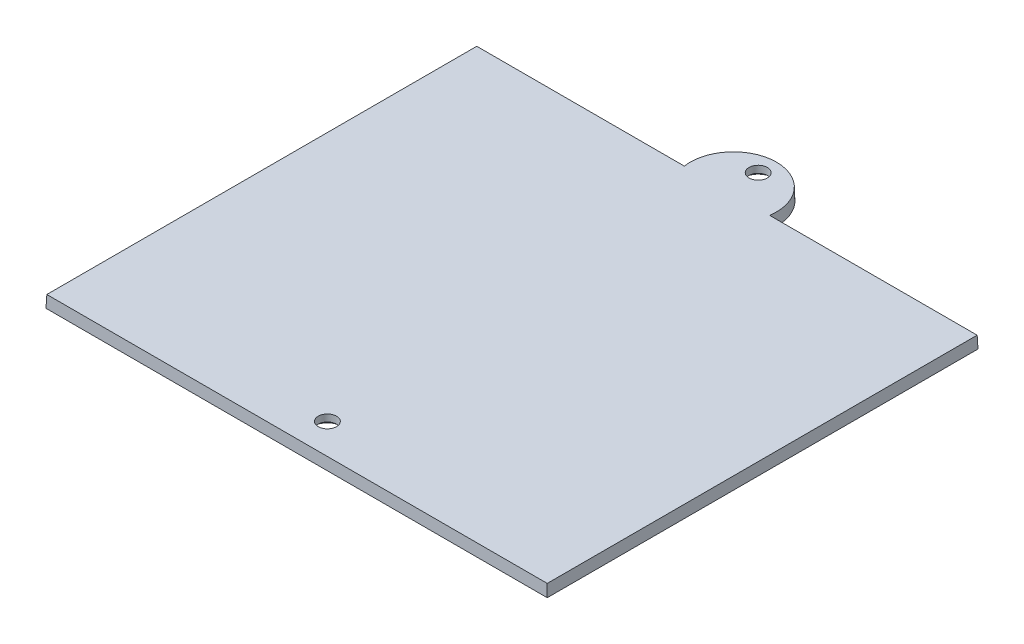
ISO-10303-21;
HEADER;
FILE_DESCRIPTION(('STEP AP214'),'2;1');
FILE_NAME('part.step','',(''),(''),'','','');
FILE_SCHEMA(('AUTOMOTIVE_DESIGN { 1 0 10303 214 1 1 1 1 }'));
ENDSEC;
DATA;
#1=APPLICATION_CONTEXT('core data for automotive mechanical design processes');
#2=APPLICATION_PROTOCOL_DEFINITION('international standard','automotive_design',2000,#1);
#3=PRODUCT_CONTEXT('',#1,'mechanical');
#4=PRODUCT('Part','Part','',(#3));
#5=PRODUCT_RELATED_PRODUCT_CATEGORY('part','',(#4));
#6=PRODUCT_DEFINITION_FORMATION('','',#4);
#7=PRODUCT_DEFINITION_CONTEXT('part definition',#1,'design');
#8=PRODUCT_DEFINITION('design','',#6,#7);
#9=PRODUCT_DEFINITION_SHAPE('','',#8);
#10=(LENGTH_UNIT() NAMED_UNIT(*) SI_UNIT(.MILLI.,.METRE.));
#11=(NAMED_UNIT(*) PLANE_ANGLE_UNIT() SI_UNIT($,.RADIAN.));
#12=(NAMED_UNIT(*) SI_UNIT($,.STERADIAN.) SOLID_ANGLE_UNIT());
#13=UNCERTAINTY_MEASURE_WITH_UNIT(LENGTH_MEASURE(1.E-05),#10,'distance_accuracy_value','');
#14=(GEOMETRIC_REPRESENTATION_CONTEXT(3) GLOBAL_UNCERTAINTY_ASSIGNED_CONTEXT((#13)) GLOBAL_UNIT_ASSIGNED_CONTEXT((#10,
#11,#12)) REPRESENTATION_CONTEXT('',''));
#15=CARTESIAN_POINT('',(0.,0.,0.));
#16=DIRECTION('',(0.,0.,1.));
#17=DIRECTION('',(1.,0.,0.));
#18=AXIS2_PLACEMENT_3D('',#15,#16,#17);
#19=CARTESIAN_POINT('',(94.0337235646274,56.6839207749224,113.170136337116));
#20=DIRECTION('',(0.999390827019096,0.034899496702501,0.));
#21=DIRECTION('',(-0.034899496702501,0.999390827019096,0.));
#22=AXIS2_PLACEMENT_3D('',#19,#20,#21);
#23=PLANE('',#22);
#24=DIRECTION('',(0.,0.,1.));
#25=VECTOR('',#24,1.);
#26=CARTESIAN_POINT('',(94.0337235646274,56.6839207749224,113.170136337116));
#27=LINE('',#26,#25);
#28=CARTESIAN_POINT('',(94.0337235646274,56.6839207749224,113.170136337116));
#29=VERTEX_POINT('',#28);
#30=CARTESIAN_POINT('',(94.0337235646273,56.6839207749224,184.908005707105));
#31=VERTEX_POINT('',#30);
#32=EDGE_CURVE('E98',#29,#31,#27,.T.);
#33=ORIENTED_EDGE('',*,*,#32,.F.);
#34=DIRECTION('',(0.0348782627423747,-0.998782765958718,-0.0348782627423747));
#35=VECTOR('',#34,1.);
#36=CARTESIAN_POINT('',(94.0337235646274,56.6839207749224,113.170136337116));
#37=LINE('',#36,#35);
#38=CARTESIAN_POINT('',(93.9638820256438,58.6839207749224,113.2399778761));
#39=VERTEX_POINT('',#38);
#40=EDGE_CURVE('E11',#39,#29,#37,.T.);
#41=ORIENTED_EDGE('',*,*,#40,.F.);
#42=DIRECTION('',(0.,0.,1.));
#43=VECTOR('',#42,1.);
#44=CARTESIAN_POINT('',(93.9638820256438,58.6839207749224,112.170136337116));
#45=LINE('',#44,#43);
#46=CARTESIAN_POINT('',(93.9638820256438,58.6839207749224,184.838164168122));
#47=VERTEX_POINT('',#46);
#48=EDGE_CURVE('E100',#39,#47,#45,.T.);
#49=ORIENTED_EDGE('',*,*,#48,.T.);
#50=DIRECTION('',(0.0348782627423747,-0.998782765958718,0.0348782627423747));
#51=VECTOR('',#50,1.);
#52=CARTESIAN_POINT('',(93.9464549335007,59.182967399518,184.820737075979));
#53=LINE('',#52,#51);
#54=EDGE_CURVE('E76',#47,#31,#53,.T.);
#55=ORIENTED_EDGE('',*,*,#54,.T.);
#56=EDGE_LOOP('',(#33,#41,#49,#55));
#57=FACE_BOUND('',#56,.T.);
#58=ADVANCED_FACE('F33',(#57),#23,.T.);
#59=CARTESIAN_POINT('',(94.0337235646274,56.6839207749224,113.170136337116));
#60=DIRECTION('',(0.,0.034899496702501,-0.999390827019096));
#61=DIRECTION('',(0.,0.999390827019096,0.034899496702501));
#62=AXIS2_PLACEMENT_3D('',#59,#60,#61);
#63=PLANE('',#62);
#64=DIRECTION('',(1.,0.,0.));
#65=VECTOR('',#64,1.);
#66=CARTESIAN_POINT('',(94.0337235646274,56.6839207749224,113.170136337116));
#67=LINE('',#66,#65);
#68=CARTESIAN_POINT('',(59.4770144869427,56.6839207749224,113.170136337116));
#69=VERTEX_POINT('',#68);
#70=EDGE_CURVE('E111',#69,#29,#67,.T.);
#71=ORIENTED_EDGE('',*,*,#70,.F.);
#72=CARTESIAN_POINT('',(59.396319249665,58.6839207749224,113.2399778761));
#73=CARTESIAN_POINT('',(59.4098443286176,58.350590499124,113.228337726374));
#74=CARTESIAN_POINT('',(59.4233314712008,58.0172586945476,113.216697523262));
#75=CARTESIAN_POINT('',(59.4502298836267,57.350592027881,113.193417010268));
#76=CARTESIAN_POINT('',(59.4636411534694,57.0172571657906,113.181776700385));
#77=CARTESIAN_POINT('',(59.4770144869427,56.6839207749224,113.170136337116));
#78=B_SPLINE_CURVE_WITH_KNOTS('',3,(#72,#73,#74,#75,#76,#77),.UNSPECIFIED.,.F.,.F.,(4,2,4),(0.,
1.00142268976236,2.00284537939931),.UNSPECIFIED.);
#79=CARTESIAN_POINT('',(59.396319249665,58.6839207749224,113.2399778761));
#80=VERTEX_POINT('',#79);
#81=EDGE_CURVE('E43',#80,#69,#78,.T.);
#82=ORIENTED_EDGE('',*,*,#81,.F.);
#83=DIRECTION('',(1.,0.,0.));
#84=VECTOR('',#83,1.);
#85=CARTESIAN_POINT('',(52.2963111787701,58.6839207749224,113.2399778761));
#86=LINE('',#85,#84);
#87=EDGE_CURVE('E101',#80,#39,#86,.T.);
#88=ORIENTED_EDGE('',*,*,#87,.T.);
#89=ORIENTED_EDGE('',*,*,#40,.T.);
#90=EDGE_LOOP('',(#71,#82,#88,#89));
#91=FACE_BOUND('',#90,.T.);
#92=ADVANCED_FACE('F150',(#91),#63,.T.);
#93=CARTESIAN_POINT('',(52.2963111787701,56.6839207749224,112.170136337116));
#94=DIRECTION('',(0.,-1.,0.));
#95=DIRECTION('',(0.,0.,-1.));
#96=AXIS2_PLACEMENT_3D('',#93,#94,#95);
#97=CONICAL_SURFACE('',#96,7.25,0.0349065850398867);
#98=CARTESIAN_POINT('',(52.2963111787701,56.6839207749224,112.170136337116));
#99=DIRECTION('',(0.,-1.,0.));
#100=DIRECTION('',(0.,0.,-1.));
#101=AXIS2_PLACEMENT_3D('',#98,#99,#100);
#102=CIRCLE('',#101,7.25);
#103=CARTESIAN_POINT('',(45.1156078705976,56.6839207749224,113.170136337116));
#104=VERTEX_POINT('',#103);
#105=EDGE_CURVE('E123',#104,#69,#102,.T.);
#106=ORIENTED_EDGE('',*,*,#105,.F.);
#107=CARTESIAN_POINT('',(45.1963031078753,58.6839207749224,113.2399778761));
#108=CARTESIAN_POINT('',(45.1827780289227,58.350590499124,113.228337726374));
#109=CARTESIAN_POINT('',(45.1692908863395,58.0172586945476,113.216697523262));
#110=CARTESIAN_POINT('',(45.1423924739136,57.350592027881,113.193417010268));
#111=CARTESIAN_POINT('',(45.1289812040709,57.0172571657906,113.181776700385));
#112=CARTESIAN_POINT('',(45.1156078705976,56.6839207749224,113.170136337116));
#113=B_SPLINE_CURVE_WITH_KNOTS('',3,(#107,#108,#109,#110,#111,#112),.UNSPECIFIED.,.F.,.F.,(4,2,
4),(0.,1.00142268976236,2.00284537939931),.UNSPECIFIED.);
#114=CARTESIAN_POINT('',(45.1963031078753,58.6839207749224,113.2399778761));
#115=VERTEX_POINT('',#114);
#116=EDGE_CURVE('E129',#115,#104,#113,.T.);
#117=ORIENTED_EDGE('',*,*,#116,.F.);
#118=CARTESIAN_POINT('',(52.2963111787701,58.6839207749224,112.170136337116));
#119=DIRECTION('',(0.,-1.,0.));
#120=DIRECTION('',(0.,0.,-1.));
#121=AXIS2_PLACEMENT_3D('',#118,#119,#120);
#122=CIRCLE('',#121,7.18015846101651);
#123=EDGE_CURVE('E272',#115,#80,#122,.T.);
#124=ORIENTED_EDGE('',*,*,#123,.T.);
#125=ORIENTED_EDGE('',*,*,#81,.T.);
#126=EDGE_LOOP('',(#106,#117,#124,#125));
#127=FACE_BOUND('',#126,.T.);
#128=ADVANCED_FACE('F143',(#127),#97,.T.);
#129=CARTESIAN_POINT('',(45.1156078705976,56.6839207749224,113.170136337116));
#130=DIRECTION('',(0.,0.034899496702501,-0.999390827019096));
#131=DIRECTION('',(0.,0.999390827019096,0.034899496702501));
#132=AXIS2_PLACEMENT_3D('',#129,#130,#131);
#133=PLANE('',#132);
#134=DIRECTION('',(1.,0.,0.));
#135=VECTOR('',#134,1.);
#136=CARTESIAN_POINT('',(45.1156078705976,56.6839207749224,113.170136337116));
#137=LINE('',#136,#135);
#138=CARTESIAN_POINT('',(10.558898792913,56.6839207749224,113.170136337116));
#139=VERTEX_POINT('',#138);
#140=EDGE_CURVE('E120',#139,#104,#137,.T.);
#141=ORIENTED_EDGE('',*,*,#140,.F.);
#142=DIRECTION('',(-0.0348782627423747,-0.998782765958718,-0.0348782627423747));
#143=VECTOR('',#142,1.);
#144=CARTESIAN_POINT('',(10.558898792913,56.6839207749224,113.170136337116));
#145=LINE('',#144,#143);
#146=CARTESIAN_POINT('',(10.6287403318965,58.6839207749224,113.2399778761));
#147=VERTEX_POINT('',#146);
#148=EDGE_CURVE('E127',#147,#139,#145,.T.);
#149=ORIENTED_EDGE('',*,*,#148,.F.);
#150=DIRECTION('',(1.,0.,0.));
#151=VECTOR('',#150,1.);
#152=CARTESIAN_POINT('',(52.2963111787701,58.6839207749224,113.2399778761));
#153=LINE('',#152,#151);
#154=EDGE_CURVE('E168',#147,#115,#153,.T.);
#155=ORIENTED_EDGE('',*,*,#154,.T.);
#156=ORIENTED_EDGE('',*,*,#116,.T.);
#157=EDGE_LOOP('',(#141,#149,#155,#156));
#158=FACE_BOUND('',#157,.T.);
#159=ADVANCED_FACE('F146',(#158),#133,.T.);
#160=CARTESIAN_POINT('',(10.558898792913,56.6839207749224,113.170136337116));
#161=DIRECTION('',(-0.999390827019096,0.034899496702501,0.));
#162=DIRECTION('',(-0.034899496702501,-0.999390827019096,0.));
#163=AXIS2_PLACEMENT_3D('',#160,#161,#162);
#164=PLANE('',#163);
#165=DIRECTION('',(0.,0.,-1.));
#166=VECTOR('',#165,1.);
#167=CARTESIAN_POINT('',(10.558898792913,56.6839207749224,113.170136337116));
#168=LINE('',#167,#166);
#169=CARTESIAN_POINT('',(10.5588987929129,56.6839207749224,184.908005707105));
#170=VERTEX_POINT('',#169);
#171=EDGE_CURVE('E108',#170,#139,#168,.T.);
#172=ORIENTED_EDGE('',*,*,#171,.F.);
#173=DIRECTION('',(-0.0348782627423747,-0.998782765958718,0.0348782627423747));
#174=VECTOR('',#173,1.);
#175=CARTESIAN_POINT('',(10.6604453506144,59.5918337212711,184.806459149404));
#176=LINE('',#175,#174);
#177=CARTESIAN_POINT('',(10.6287403318964,58.6839207749224,184.838164168122));
#178=VERTEX_POINT('',#177);
#179=EDGE_CURVE('E69',#178,#170,#176,.T.);
#180=ORIENTED_EDGE('',*,*,#179,.F.);
#181=DIRECTION('',(0.,0.,-1.));
#182=VECTOR('',#181,1.);
#183=CARTESIAN_POINT('',(10.6287403318965,58.6839207749224,112.170136337116));
#184=LINE('',#183,#182);
#185=EDGE_CURVE('E276',#178,#147,#184,.T.);
#186=ORIENTED_EDGE('',*,*,#185,.T.);
#187=ORIENTED_EDGE('',*,*,#148,.T.);
#188=EDGE_LOOP('',(#172,#180,#186,#187));
#189=FACE_BOUND('',#188,.T.);
#190=ADVANCED_FACE('F35',(#189),#164,.T.);
#191=CARTESIAN_POINT('',(94.0337235646273,56.6839207749224,184.908005707105));
#192=DIRECTION('',(0.,0.034899496702501,0.999390827019096));
#193=DIRECTION('',(0.,-0.999390827019096,0.034899496702501));
#194=AXIS2_PLACEMENT_3D('',#191,#192,#193);
#195=PLANE('',#194);
#196=DIRECTION('',(-1.,0.,0.));
#197=VECTOR('',#196,1.);
#198=CARTESIAN_POINT('',(94.0337235646273,56.6839207749224,184.908005707105));
#199=LINE('',#198,#197);
#200=EDGE_CURVE('E104',#31,#170,#199,.T.);
#201=ORIENTED_EDGE('',*,*,#200,.F.);
#202=ORIENTED_EDGE('',*,*,#54,.F.);
#203=DIRECTION('',(-1.,0.,0.));
#204=VECTOR('',#203,1.);
#205=CARTESIAN_POINT('',(52.2963111787701,58.6839207749224,184.838164168122));
#206=LINE('',#205,#204);
#207=EDGE_CURVE('E37',#47,#178,#206,.T.);
#208=ORIENTED_EDGE('',*,*,#207,.T.);
#209=ORIENTED_EDGE('',*,*,#179,.T.);
#210=EDGE_LOOP('',(#201,#202,#208,#209));
#211=FACE_BOUND('',#210,.T.);
#212=ADVANCED_FACE('F105',(#211),#195,.T.);
#213=CARTESIAN_POINT('',(52.2963111787701,58.6839207749224,112.170136337116));
#214=DIRECTION('',(0.,-1.,0.));
#215=DIRECTION('',(0.,0.,-1.));
#216=AXIS2_PLACEMENT_3D('',#213,#214,#215);
#217=PLANE('',#216);
#218=CARTESIAN_POINT('',(52.2963111787701,58.6839207749224,108.045136337116));
#219=DIRECTION('',(0.,-1.,0.));
#220=DIRECTION('',(0.,0.,-1.));
#221=AXIS2_PLACEMENT_3D('',#218,#219,#220);
#222=CIRCLE('',#221,1.524);
#223=CARTESIAN_POINT('',(52.2963111787701,58.6839207749224,106.521136337116));
#224=VERTEX_POINT('',#223);
#225=EDGE_CURVE('E253',#224,#224,#222,.T.);
#226=ORIENTED_EDGE('',*,*,#225,.T.);
#227=EDGE_LOOP('',(#226));
#228=FACE_BOUND('',#227,.T.);
#229=CARTESIAN_POINT('',(52.2963111787701,58.6839207749224,179.783005707105));
#230=DIRECTION('',(0.,-1.,0.));
#231=DIRECTION('',(0.,0.,-1.));
#232=AXIS2_PLACEMENT_3D('',#229,#230,#231);
#233=CIRCLE('',#232,1.524);
#234=CARTESIAN_POINT('',(52.2963111787701,58.6839207749224,178.259005707105));
#235=VERTEX_POINT('',#234);
#236=EDGE_CURVE('E112',#235,#235,#233,.T.);
#237=ORIENTED_EDGE('',*,*,#236,.T.);
#238=EDGE_LOOP('',(#237));
#239=FACE_BOUND('',#238,.T.);
#240=ORIENTED_EDGE('',*,*,#48,.F.);
#241=ORIENTED_EDGE('',*,*,#87,.F.);
#242=ORIENTED_EDGE('',*,*,#123,.F.);
#243=ORIENTED_EDGE('',*,*,#154,.F.);
#244=ORIENTED_EDGE('',*,*,#185,.F.);
#245=ORIENTED_EDGE('',*,*,#207,.F.);
#246=EDGE_LOOP('',(#240,#241,#242,#243,#244,#245));
#247=FACE_BOUND('',#246,.T.);
#248=ADVANCED_FACE('F156',(#228,#239,#247),#217,.F.);
#249=CARTESIAN_POINT('',(52.2963111787701,56.6839207749224,112.170136337116));
#250=DIRECTION('',(0.,-1.,0.));
#251=DIRECTION('',(0.,0.,-1.));
#252=AXIS2_PLACEMENT_3D('',#249,#250,#251);
#253=PLANE('',#252);
#254=CARTESIAN_POINT('',(52.2963111787701,56.6839207749224,108.045136337116));
#255=DIRECTION('',(0.,-1.,0.));
#256=DIRECTION('',(0.,0.,-1.));
#257=AXIS2_PLACEMENT_3D('',#254,#255,#256);
#258=CIRCLE('',#257,2.5273);
#259=CARTESIAN_POINT('',(52.2963111787701,56.6839207749224,105.517836337116));
#260=VERTEX_POINT('',#259);
#261=EDGE_CURVE('E251',#260,#260,#258,.T.);
#262=ORIENTED_EDGE('',*,*,#261,.F.);
#263=EDGE_LOOP('',(#262));
#264=FACE_BOUND('',#263,.T.);
#265=CARTESIAN_POINT('',(52.2963111787701,56.6839207749224,179.783005707105));
#266=DIRECTION('',(0.,-1.,0.));
#267=DIRECTION('',(0.,0.,-1.));
#268=AXIS2_PLACEMENT_3D('',#265,#266,#267);
#269=CIRCLE('',#268,2.5273);
#270=CARTESIAN_POINT('',(52.2963111787701,56.6839207749224,177.255705707105));
#271=VERTEX_POINT('',#270);
#272=EDGE_CURVE('E258',#271,#271,#269,.T.);
#273=ORIENTED_EDGE('',*,*,#272,.F.);
#274=EDGE_LOOP('',(#273));
#275=FACE_BOUND('',#274,.T.);
#276=ORIENTED_EDGE('',*,*,#32,.T.);
#277=ORIENTED_EDGE('',*,*,#200,.T.);
#278=ORIENTED_EDGE('',*,*,#171,.T.);
#279=ORIENTED_EDGE('',*,*,#140,.T.);
#280=ORIENTED_EDGE('',*,*,#105,.T.);
#281=ORIENTED_EDGE('',*,*,#70,.T.);
#282=EDGE_LOOP('',(#276,#277,#278,#279,#280,#281));
#283=FACE_BOUND('',#282,.T.);
#284=ADVANCED_FACE('F110',(#264,#275,#283),#253,.T.);
#285=CARTESIAN_POINT('',(52.2963111787701,56.6839207749224,179.783005707105));
#286=DIRECTION('',(0.,-1.,0.));
#287=DIRECTION('',(0.,0.,-1.));
#288=AXIS2_PLACEMENT_3D('',#285,#286,#287);
#289=CYLINDRICAL_SURFACE('',#288,1.52399999999999);
#290=ORIENTED_EDGE('',*,*,#236,.F.);
#291=EDGE_LOOP('',(#290));
#292=FACE_BOUND('',#291,.T.);
#293=CARTESIAN_POINT('',(52.2963111787701,57.5257894348826,179.783005707105));
#294=DIRECTION('',(0.,-1.,0.));
#295=DIRECTION('',(0.,0.,-1.));
#296=AXIS2_PLACEMENT_3D('',#293,#294,#295);
#297=CIRCLE('',#296,1.52399999999999);
#298=CARTESIAN_POINT('',(52.2963111787701,57.5257894348826,178.259005707105));
#299=VERTEX_POINT('',#298);
#300=EDGE_CURVE('E115',#299,#299,#297,.T.);
#301=ORIENTED_EDGE('',*,*,#300,.T.);
#302=EDGE_LOOP('',(#301));
#303=FACE_BOUND('',#302,.T.);
#304=ADVANCED_FACE('F202',(#292,#303),#289,.F.);
#305=CARTESIAN_POINT('',(52.2963111787701,56.6839207749224,179.783005707105));
#306=DIRECTION('',(0.,-1.,0.));
#307=DIRECTION('',(0.,0.,-1.));
#308=AXIS2_PLACEMENT_3D('',#305,#306,#307);
#309=CONICAL_SURFACE('',#308,2.5273,0.872664625997163);
#310=ORIENTED_EDGE('',*,*,#300,.F.);
#311=EDGE_LOOP('',(#310));
#312=FACE_BOUND('',#311,.T.);
#313=ORIENTED_EDGE('',*,*,#272,.T.);
#314=EDGE_LOOP('',(#313));
#315=FACE_BOUND('',#314,.T.);
#316=ADVANCED_FACE('F211',(#312,#315),#309,.F.);
#317=CARTESIAN_POINT('',(52.2963111787701,56.6839207749224,108.045136337116));
#318=DIRECTION('',(0.,-1.,0.));
#319=DIRECTION('',(0.,0.,-1.));
#320=AXIS2_PLACEMENT_3D('',#317,#318,#319);
#321=CYLINDRICAL_SURFACE('',#320,1.52399999999999);
#322=ORIENTED_EDGE('',*,*,#225,.F.);
#323=EDGE_LOOP('',(#322));
#324=FACE_BOUND('',#323,.T.);
#325=CARTESIAN_POINT('',(52.2963111787701,57.5257894348826,108.045136337116));
#326=DIRECTION('',(0.,-1.,0.));
#327=DIRECTION('',(0.,0.,-1.));
#328=AXIS2_PLACEMENT_3D('',#325,#326,#327);
#329=CIRCLE('',#328,1.52399999999999);
#330=CARTESIAN_POINT('',(52.2963111787701,57.5257894348826,106.521136337116));
#331=VERTEX_POINT('',#330);
#332=EDGE_CURVE('E248',#331,#331,#329,.T.);
#333=ORIENTED_EDGE('',*,*,#332,.T.);
#334=EDGE_LOOP('',(#333));
#335=FACE_BOUND('',#334,.T.);
#336=ADVANCED_FACE('F221',(#324,#335),#321,.F.);
#337=CARTESIAN_POINT('',(52.2963111787701,56.6839207749224,108.045136337116));
#338=DIRECTION('',(0.,-1.,0.));
#339=DIRECTION('',(0.,0.,-1.));
#340=AXIS2_PLACEMENT_3D('',#337,#338,#339);
#341=CONICAL_SURFACE('',#340,2.5273,0.872664625997163);
#342=ORIENTED_EDGE('',*,*,#332,.F.);
#343=EDGE_LOOP('',(#342));
#344=FACE_BOUND('',#343,.T.);
#345=ORIENTED_EDGE('',*,*,#261,.T.);
#346=EDGE_LOOP('',(#345));
#347=FACE_BOUND('',#346,.T.);
#348=ADVANCED_FACE('F231',(#344,#347),#341,.F.);
#349=CLOSED_SHELL('',(#58,#92,#128,#159,#190,#212,#248,#284,#304,#316,#336,#348));
#350=MANIFOLD_SOLID_BREP('B2',#349);
#351=ADVANCED_BREP_SHAPE_REPRESENTATION('',(#18,#350),#14);
#352=SHAPE_DEFINITION_REPRESENTATION(#9,#351);
ENDSEC;
END-ISO-10303-21;
